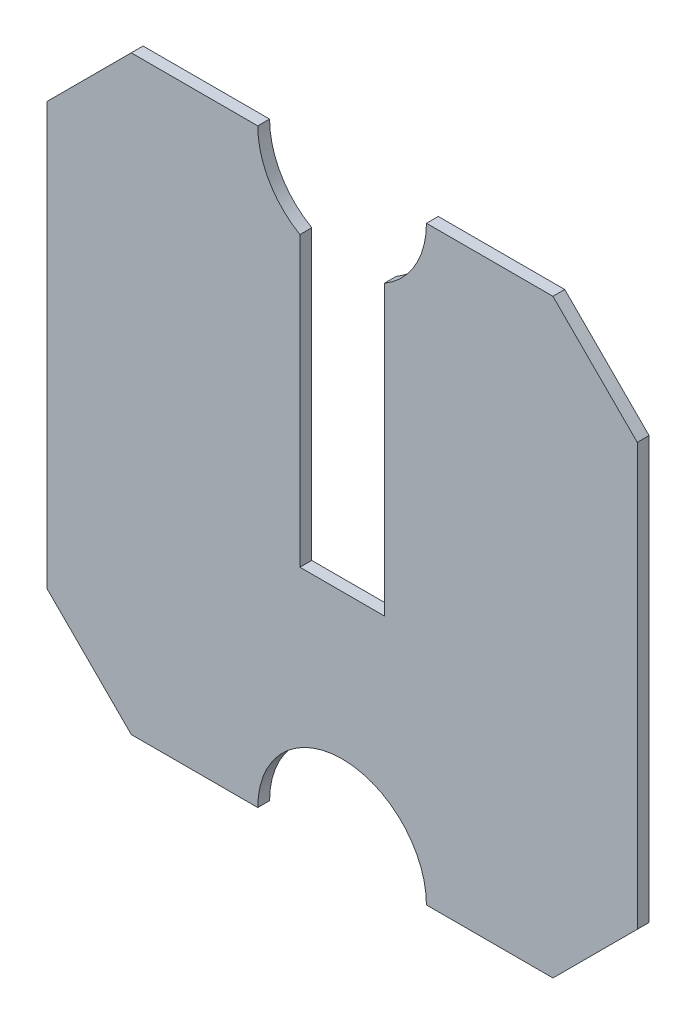
ISO-10303-21;
HEADER;
FILE_DESCRIPTION(('STEP AP214'),'2;1');
FILE_NAME('part.step','',(''),(''),'','','');
FILE_SCHEMA(('AUTOMOTIVE_DESIGN { 1 0 10303 214 1 1 1 1 }'));
ENDSEC;
DATA;
#1=APPLICATION_CONTEXT('core data for automotive mechanical design processes');
#2=APPLICATION_PROTOCOL_DEFINITION('international standard','automotive_design',2000,#1);
#3=PRODUCT_CONTEXT('',#1,'mechanical');
#4=PRODUCT('Part','Part','',(#3));
#5=PRODUCT_RELATED_PRODUCT_CATEGORY('part','',(#4));
#6=PRODUCT_DEFINITION_FORMATION('','',#4);
#7=PRODUCT_DEFINITION_CONTEXT('part definition',#1,'design');
#8=PRODUCT_DEFINITION('design','',#6,#7);
#9=PRODUCT_DEFINITION_SHAPE('','',#8);
#10=(LENGTH_UNIT() NAMED_UNIT(*) SI_UNIT(.MILLI.,.METRE.));
#11=(NAMED_UNIT(*) PLANE_ANGLE_UNIT() SI_UNIT($,.RADIAN.));
#12=(NAMED_UNIT(*) SI_UNIT($,.STERADIAN.) SOLID_ANGLE_UNIT());
#13=UNCERTAINTY_MEASURE_WITH_UNIT(LENGTH_MEASURE(1.E-05),#10,'distance_accuracy_value','');
#14=(GEOMETRIC_REPRESENTATION_CONTEXT(3) GLOBAL_UNCERTAINTY_ASSIGNED_CONTEXT((#13)) GLOBAL_UNIT_ASSIGNED_CONTEXT((#10,
#11,#12)) REPRESENTATION_CONTEXT('',''));
#15=CARTESIAN_POINT('',(0.,0.,0.));
#16=DIRECTION('',(0.,0.,1.));
#17=DIRECTION('',(1.,0.,0.));
#18=AXIS2_PLACEMENT_3D('',#15,#16,#17);
#19=CARTESIAN_POINT('',(175.,300.,7.));
#20=DIRECTION('',(0.,0.,-1.));
#21=DIRECTION('',(-1.,0.,0.));
#22=AXIS2_PLACEMENT_3D('',#19,#20,#21);
#23=CYLINDRICAL_SURFACE('',#22,50.);
#24=CARTESIAN_POINT('',(175.,300.,0.));
#25=DIRECTION('',(0.,0.,-1.));
#26=DIRECTION('',(1.,0.,0.));
#27=AXIS2_PLACEMENT_3D('',#24,#25,#26);
#28=CIRCLE('',#27,50.);
#29=CARTESIAN_POINT('',(225.,300.,0.));
#30=VERTEX_POINT('',#29);
#31=CARTESIAN_POINT('',(200.,256.698729810778,0.));
#32=VERTEX_POINT('',#31);
#33=EDGE_CURVE('E188',#30,#32,#28,.T.);
#34=ORIENTED_EDGE('',*,*,#33,.T.);
#35=DIRECTION('',(0.,0.,-1.));
#36=VECTOR('',#35,1.);
#37=CARTESIAN_POINT('',(200.,256.698729810778,7.));
#38=LINE('',#37,#36);
#39=CARTESIAN_POINT('',(200.,256.698729810778,7.));
#40=VERTEX_POINT('',#39);
#41=EDGE_CURVE('E173',#32,#40,#38,.F.);
#42=ORIENTED_EDGE('',*,*,#41,.T.);
#43=CARTESIAN_POINT('',(175.,300.,7.));
#44=DIRECTION('',(0.,0.,-1.));
#45=DIRECTION('',(1.,0.,0.));
#46=AXIS2_PLACEMENT_3D('',#43,#44,#45);
#47=CIRCLE('',#46,50.);
#48=CARTESIAN_POINT('',(225.,300.,7.));
#49=VERTEX_POINT('',#48);
#50=EDGE_CURVE('E151',#49,#40,#47,.T.);
#51=ORIENTED_EDGE('',*,*,#50,.F.);
#52=DIRECTION('',(0.,0.,-1.));
#53=VECTOR('',#52,1.);
#54=CARTESIAN_POINT('',(225.,300.,7.));
#55=LINE('',#54,#53);
#56=EDGE_CURVE('E199',#49,#30,#55,.T.);
#57=ORIENTED_EDGE('',*,*,#56,.T.);
#58=EDGE_LOOP('',(#34,#42,#51,#57));
#59=FACE_BOUND('',#58,.T.);
#60=ADVANCED_FACE('F33',(#59),#23,.F.);
#61=CARTESIAN_POINT('',(50.,-50.0000000000002,7.));
#62=DIRECTION('',(0.707106781186548,0.707106781186547,0.));
#63=DIRECTION('',(-0.707106781186547,0.707106781186548,0.));
#64=AXIS2_PLACEMENT_3D('',#61,#62,#63);
#65=PLANE('',#64);
#66=DIRECTION('',(0.707106781186547,-0.707106781186548,0.));
#67=VECTOR('',#66,1.);
#68=CARTESIAN_POINT('',(50.,-50.0000000000002,0.));
#69=LINE('',#68,#67);
#70=CARTESIAN_POINT('',(0.,0.,0.));
#71=VERTEX_POINT('',#70);
#72=CARTESIAN_POINT('',(50.,-50.0000000000002,0.));
#73=VERTEX_POINT('',#72);
#74=EDGE_CURVE('E169',#71,#73,#69,.T.);
#75=ORIENTED_EDGE('',*,*,#74,.T.);
#76=DIRECTION('',(0.,0.,-1.));
#77=VECTOR('',#76,1.);
#78=CARTESIAN_POINT('',(50.,-50.0000000000002,7.));
#79=LINE('',#78,#77);
#80=CARTESIAN_POINT('',(50.,-50.0000000000002,7.));
#81=VERTEX_POINT('',#80);
#82=EDGE_CURVE('E41',#81,#73,#79,.T.);
#83=ORIENTED_EDGE('',*,*,#82,.F.);
#84=DIRECTION('',(0.707106781186547,-0.707106781186548,0.));
#85=VECTOR('',#84,1.);
#86=CARTESIAN_POINT('',(50.,-50.0000000000002,7.));
#87=LINE('',#86,#85);
#88=CARTESIAN_POINT('',(0.,0.,7.));
#89=VERTEX_POINT('',#88);
#90=EDGE_CURVE('E195',#89,#81,#87,.T.);
#91=ORIENTED_EDGE('',*,*,#90,.F.);
#92=DIRECTION('',(0.,0.,-1.));
#93=VECTOR('',#92,1.);
#94=CARTESIAN_POINT('',(0.,0.,7.));
#95=LINE('',#94,#93);
#96=EDGE_CURVE('E165',#89,#71,#95,.T.);
#97=ORIENTED_EDGE('',*,*,#96,.T.);
#98=EDGE_LOOP('',(#75,#83,#91,#97));
#99=FACE_BOUND('',#98,.T.);
#100=ADVANCED_FACE('F35',(#99),#65,.F.);
#101=CARTESIAN_POINT('',(125.,-50.0000000000002,7.));
#102=DIRECTION('',(0.,1.,0.));
#103=DIRECTION('',(-1.,0.,0.));
#104=AXIS2_PLACEMENT_3D('',#101,#102,#103);
#105=PLANE('',#104);
#106=DIRECTION('',(1.,0.,0.));
#107=VECTOR('',#106,1.);
#108=CARTESIAN_POINT('',(125.,-50.0000000000002,0.));
#109=LINE('',#108,#107);
#110=CARTESIAN_POINT('',(125.,-50.0000000000001,0.));
#111=VERTEX_POINT('',#110);
#112=EDGE_CURVE('E172',#73,#111,#109,.T.);
#113=ORIENTED_EDGE('',*,*,#112,.T.);
#114=DIRECTION('',(0.,0.,-1.));
#115=VECTOR('',#114,1.);
#116=CARTESIAN_POINT('',(125.,-50.0000000000001,7.));
#117=LINE('',#116,#115);
#118=CARTESIAN_POINT('',(125.,-50.0000000000001,7.));
#119=VERTEX_POINT('',#118);
#120=EDGE_CURVE('E217',#119,#111,#117,.T.);
#121=ORIENTED_EDGE('',*,*,#120,.F.);
#122=DIRECTION('',(1.,0.,0.));
#123=VECTOR('',#122,1.);
#124=CARTESIAN_POINT('',(125.,-50.0000000000002,7.));
#125=LINE('',#124,#123);
#126=EDGE_CURVE('E111',#81,#119,#125,.T.);
#127=ORIENTED_EDGE('',*,*,#126,.F.);
#128=ORIENTED_EDGE('',*,*,#82,.T.);
#129=EDGE_LOOP('',(#113,#121,#127,#128));
#130=FACE_BOUND('',#129,.T.);
#131=ADVANCED_FACE('F220',(#130),#105,.F.);
#132=CARTESIAN_POINT('',(175.,-50.0000000000002,7.));
#133=DIRECTION('',(0.,0.,-1.));
#134=DIRECTION('',(-1.,0.,0.));
#135=AXIS2_PLACEMENT_3D('',#132,#133,#134);
#136=CYLINDRICAL_SURFACE('',#135,50.);
#137=CARTESIAN_POINT('',(175.,-50.0000000000002,0.));
#138=DIRECTION('',(0.,0.,-1.));
#139=DIRECTION('',(1.,0.,0.));
#140=AXIS2_PLACEMENT_3D('',#137,#138,#139);
#141=CIRCLE('',#140,50.);
#142=CARTESIAN_POINT('',(225.,-50.0000000000002,0.));
#143=VERTEX_POINT('',#142);
#144=EDGE_CURVE('E175',#111,#143,#141,.T.);
#145=ORIENTED_EDGE('',*,*,#144,.T.);
#146=DIRECTION('',(0.,0.,-1.));
#147=VECTOR('',#146,1.);
#148=CARTESIAN_POINT('',(225.,-50.0000000000002,7.));
#149=LINE('',#148,#147);
#150=CARTESIAN_POINT('',(225.,-50.0000000000002,7.));
#151=VERTEX_POINT('',#150);
#152=EDGE_CURVE('E214',#151,#143,#149,.T.);
#153=ORIENTED_EDGE('',*,*,#152,.F.);
#154=CARTESIAN_POINT('',(175.,-50.0000000000002,7.));
#155=DIRECTION('',(0.,0.,-1.));
#156=DIRECTION('',(1.,0.,0.));
#157=AXIS2_PLACEMENT_3D('',#154,#155,#156);
#158=CIRCLE('',#157,50.);
#159=EDGE_CURVE('E240',#119,#151,#158,.T.);
#160=ORIENTED_EDGE('',*,*,#159,.F.);
#161=ORIENTED_EDGE('',*,*,#120,.T.);
#162=EDGE_LOOP('',(#145,#153,#160,#161));
#163=FACE_BOUND('',#162,.T.);
#164=ADVANCED_FACE('F231',(#163),#136,.F.);
#165=CARTESIAN_POINT('',(300.,-50.0000000000001,7.));
#166=DIRECTION('',(0.,1.,0.));
#167=DIRECTION('',(-1.,0.,0.));
#168=AXIS2_PLACEMENT_3D('',#165,#166,#167);
#169=PLANE('',#168);
#170=DIRECTION('',(1.,0.,0.));
#171=VECTOR('',#170,1.);
#172=CARTESIAN_POINT('',(300.,-50.0000000000001,0.));
#173=LINE('',#172,#171);
#174=CARTESIAN_POINT('',(300.,-50.0000000000001,0.));
#175=VERTEX_POINT('',#174);
#176=EDGE_CURVE('E177',#143,#175,#173,.T.);
#177=ORIENTED_EDGE('',*,*,#176,.T.);
#178=DIRECTION('',(0.,0.,-1.));
#179=VECTOR('',#178,1.);
#180=CARTESIAN_POINT('',(300.,-50.0000000000001,7.));
#181=LINE('',#180,#179);
#182=CARTESIAN_POINT('',(300.,-50.0000000000001,7.));
#183=VERTEX_POINT('',#182);
#184=EDGE_CURVE('E211',#183,#175,#181,.T.);
#185=ORIENTED_EDGE('',*,*,#184,.F.);
#186=DIRECTION('',(1.,0.,0.));
#187=VECTOR('',#186,1.);
#188=CARTESIAN_POINT('',(300.,-50.0000000000001,7.));
#189=LINE('',#188,#187);
#190=EDGE_CURVE('E237',#151,#183,#189,.T.);
#191=ORIENTED_EDGE('',*,*,#190,.F.);
#192=ORIENTED_EDGE('',*,*,#152,.T.);
#193=EDGE_LOOP('',(#177,#185,#191,#192));
#194=FACE_BOUND('',#193,.T.);
#195=ADVANCED_FACE('F235',(#194),#169,.F.);
#196=CARTESIAN_POINT('',(350.,0.,7.));
#197=DIRECTION('',(-0.707106781186548,0.707106781186547,0.));
#198=DIRECTION('',(-0.707106781186547,-0.707106781186548,0.));
#199=AXIS2_PLACEMENT_3D('',#196,#197,#198);
#200=PLANE('',#199);
#201=DIRECTION('',(0.707106781186547,0.707106781186548,0.));
#202=VECTOR('',#201,1.);
#203=CARTESIAN_POINT('',(350.,0.,0.));
#204=LINE('',#203,#202);
#205=CARTESIAN_POINT('',(350.,0.,0.));
#206=VERTEX_POINT('',#205);
#207=EDGE_CURVE('E179',#175,#206,#204,.T.);
#208=ORIENTED_EDGE('',*,*,#207,.T.);
#209=DIRECTION('',(0.,0.,-1.));
#210=VECTOR('',#209,1.);
#211=CARTESIAN_POINT('',(350.,0.,7.));
#212=LINE('',#211,#210);
#213=CARTESIAN_POINT('',(350.,0.,7.));
#214=VERTEX_POINT('',#213);
#215=EDGE_CURVE('E208',#214,#206,#212,.T.);
#216=ORIENTED_EDGE('',*,*,#215,.F.);
#217=DIRECTION('',(0.707106781186547,0.707106781186548,0.));
#218=VECTOR('',#217,1.);
#219=CARTESIAN_POINT('',(350.,0.,7.));
#220=LINE('',#219,#218);
#221=EDGE_CURVE('E239',#183,#214,#220,.T.);
#222=ORIENTED_EDGE('',*,*,#221,.F.);
#223=ORIENTED_EDGE('',*,*,#184,.T.);
#224=EDGE_LOOP('',(#208,#216,#222,#223));
#225=FACE_BOUND('',#224,.T.);
#226=ADVANCED_FACE('F340',(#225),#200,.F.);
#227=CARTESIAN_POINT('',(350.,250.,7.));
#228=DIRECTION('',(-1.,0.,0.));
#229=DIRECTION('',(0.,-1.,0.));
#230=AXIS2_PLACEMENT_3D('',#227,#228,#229);
#231=PLANE('',#230);
#232=DIRECTION('',(0.,1.,0.));
#233=VECTOR('',#232,1.);
#234=CARTESIAN_POINT('',(350.,250.,0.));
#235=LINE('',#234,#233);
#236=CARTESIAN_POINT('',(350.,250.,0.));
#237=VERTEX_POINT('',#236);
#238=EDGE_CURVE('E181',#206,#237,#235,.T.);
#239=ORIENTED_EDGE('',*,*,#238,.T.);
#240=DIRECTION('',(0.,0.,-1.));
#241=VECTOR('',#240,1.);
#242=CARTESIAN_POINT('',(350.,250.,7.));
#243=LINE('',#242,#241);
#244=CARTESIAN_POINT('',(350.,250.,7.));
#245=VERTEX_POINT('',#244);
#246=EDGE_CURVE('E205',#245,#237,#243,.T.);
#247=ORIENTED_EDGE('',*,*,#246,.F.);
#248=DIRECTION('',(0.,1.,0.));
#249=VECTOR('',#248,1.);
#250=CARTESIAN_POINT('',(350.,250.,7.));
#251=LINE('',#250,#249);
#252=EDGE_CURVE('E242',#214,#245,#251,.T.);
#253=ORIENTED_EDGE('',*,*,#252,.F.);
#254=ORIENTED_EDGE('',*,*,#215,.T.);
#255=EDGE_LOOP('',(#239,#247,#253,#254));
#256=FACE_BOUND('',#255,.T.);
#257=ADVANCED_FACE('F334',(#256),#231,.F.);
#258=CARTESIAN_POINT('',(300.,300.,7.));
#259=DIRECTION('',(-0.707106781186547,-0.707106781186548,0.));
#260=DIRECTION('',(0.707106781186548,-0.707106781186547,0.));
#261=AXIS2_PLACEMENT_3D('',#258,#259,#260);
#262=PLANE('',#261);
#263=DIRECTION('',(-0.707106781186548,0.707106781186547,0.));
#264=VECTOR('',#263,1.);
#265=CARTESIAN_POINT('',(300.,300.,0.));
#266=LINE('',#265,#264);
#267=CARTESIAN_POINT('',(300.,300.,0.));
#268=VERTEX_POINT('',#267);
#269=EDGE_CURVE('E183',#237,#268,#266,.T.);
#270=ORIENTED_EDGE('',*,*,#269,.T.);
#271=DIRECTION('',(0.,0.,-1.));
#272=VECTOR('',#271,1.);
#273=CARTESIAN_POINT('',(300.,300.,7.));
#274=LINE('',#273,#272);
#275=CARTESIAN_POINT('',(300.,300.,7.));
#276=VERTEX_POINT('',#275);
#277=EDGE_CURVE('E202',#276,#268,#274,.T.);
#278=ORIENTED_EDGE('',*,*,#277,.F.);
#279=DIRECTION('',(-0.707106781186548,0.707106781186547,0.));
#280=VECTOR('',#279,1.);
#281=CARTESIAN_POINT('',(300.,300.,7.));
#282=LINE('',#281,#280);
#283=EDGE_CURVE('E248',#245,#276,#282,.T.);
#284=ORIENTED_EDGE('',*,*,#283,.F.);
#285=ORIENTED_EDGE('',*,*,#246,.T.);
#286=EDGE_LOOP('',(#270,#278,#284,#285));
#287=FACE_BOUND('',#286,.T.);
#288=ADVANCED_FACE('F329',(#287),#262,.F.);
#289=CARTESIAN_POINT('',(225.,300.,7.));
#290=DIRECTION('',(0.,-1.,0.));
#291=DIRECTION('',(0.,0.,-1.));
#292=AXIS2_PLACEMENT_3D('',#289,#290,#291);
#293=PLANE('',#292);
#294=DIRECTION('',(-1.,0.,0.));
#295=VECTOR('',#294,1.);
#296=CARTESIAN_POINT('',(225.,300.,0.));
#297=LINE('',#296,#295);
#298=EDGE_CURVE('E185',#268,#30,#297,.T.);
#299=ORIENTED_EDGE('',*,*,#298,.T.);
#300=ORIENTED_EDGE('',*,*,#56,.F.);
#301=DIRECTION('',(-1.,0.,0.));
#302=VECTOR('',#301,1.);
#303=CARTESIAN_POINT('',(225.,300.,7.));
#304=LINE('',#303,#302);
#305=EDGE_CURVE('E250',#276,#49,#304,.T.);
#306=ORIENTED_EDGE('',*,*,#305,.F.);
#307=ORIENTED_EDGE('',*,*,#277,.T.);
#308=EDGE_LOOP('',(#299,#300,#306,#307));
#309=FACE_BOUND('',#308,.T.);
#310=ADVANCED_FACE('F324',(#309),#293,.F.);
#311=CARTESIAN_POINT('',(150.,256.698729810778,7.));
#312=VERTEX_POINT('',#311);
#313=CARTESIAN_POINT('',(125.,300.,7.));
#314=VERTEX_POINT('',#313);
#315=EDGE_CURVE('E147',#312,#314,#47,.T.);
#316=ORIENTED_EDGE('',*,*,#315,.F.);
#317=DIRECTION('',(0.,0.,-1.));
#318=VECTOR('',#317,1.);
#319=CARTESIAN_POINT('',(150.,256.698729810778,7.));
#320=LINE('',#319,#318);
#321=CARTESIAN_POINT('',(150.,256.698729810778,0.));
#322=VERTEX_POINT('',#321);
#323=EDGE_CURVE('E268',#312,#322,#320,.T.);
#324=ORIENTED_EDGE('',*,*,#323,.T.);
#325=CARTESIAN_POINT('',(125.,300.,0.));
#326=VERTEX_POINT('',#325);
#327=EDGE_CURVE('E187',#322,#326,#28,.T.);
#328=ORIENTED_EDGE('',*,*,#327,.T.);
#329=DIRECTION('',(0.,0.,-1.));
#330=VECTOR('',#329,1.);
#331=CARTESIAN_POINT('',(125.,300.,7.));
#332=LINE('',#331,#330);
#333=EDGE_CURVE('E160',#314,#326,#332,.T.);
#334=ORIENTED_EDGE('',*,*,#333,.F.);
#335=EDGE_LOOP('',(#316,#324,#328,#334));
#336=FACE_BOUND('',#335,.T.);
#337=ADVANCED_FACE('F304',(#336),#23,.F.);
#338=CARTESIAN_POINT('',(50.,300.,7.));
#339=DIRECTION('',(0.,-1.,0.));
#340=DIRECTION('',(0.,0.,-1.));
#341=AXIS2_PLACEMENT_3D('',#338,#339,#340);
#342=PLANE('',#341);
#343=DIRECTION('',(-1.,0.,0.));
#344=VECTOR('',#343,1.);
#345=CARTESIAN_POINT('',(50.,300.,0.));
#346=LINE('',#345,#344);
#347=CARTESIAN_POINT('',(50.,300.,0.));
#348=VERTEX_POINT('',#347);
#349=EDGE_CURVE('E157',#326,#348,#346,.T.);
#350=ORIENTED_EDGE('',*,*,#349,.T.);
#351=DIRECTION('',(0.,0.,-1.));
#352=VECTOR('',#351,1.);
#353=CARTESIAN_POINT('',(50.,300.,7.));
#354=LINE('',#353,#352);
#355=CARTESIAN_POINT('',(50.,300.,7.));
#356=VERTEX_POINT('',#355);
#357=EDGE_CURVE('E154',#356,#348,#354,.T.);
#358=ORIENTED_EDGE('',*,*,#357,.F.);
#359=DIRECTION('',(-1.,0.,0.));
#360=VECTOR('',#359,1.);
#361=CARTESIAN_POINT('',(50.,300.,7.));
#362=LINE('',#361,#360);
#363=EDGE_CURVE('E138',#314,#356,#362,.T.);
#364=ORIENTED_EDGE('',*,*,#363,.F.);
#365=ORIENTED_EDGE('',*,*,#333,.T.);
#366=EDGE_LOOP('',(#350,#358,#364,#365));
#367=FACE_BOUND('',#366,.T.);
#368=ADVANCED_FACE('F155',(#367),#342,.F.);
#369=CARTESIAN_POINT('',(0.,250.,7.));
#370=DIRECTION('',(0.707106781186547,-0.707106781186548,0.));
#371=DIRECTION('',(0.707106781186548,0.707106781186547,0.));
#372=AXIS2_PLACEMENT_3D('',#369,#370,#371);
#373=PLANE('',#372);
#374=DIRECTION('',(-0.707106781186548,-0.707106781186547,0.));
#375=VECTOR('',#374,1.);
#376=CARTESIAN_POINT('',(0.,250.,0.));
#377=LINE('',#376,#375);
#378=CARTESIAN_POINT('',(0.,250.,0.));
#379=VERTEX_POINT('',#378);
#380=EDGE_CURVE('E192',#348,#379,#377,.T.);
#381=ORIENTED_EDGE('',*,*,#380,.T.);
#382=DIRECTION('',(0.,0.,-1.));
#383=VECTOR('',#382,1.);
#384=CARTESIAN_POINT('',(0.,250.,7.));
#385=LINE('',#384,#383);
#386=CARTESIAN_POINT('',(0.,250.,7.));
#387=VERTEX_POINT('',#386);
#388=EDGE_CURVE('E161',#387,#379,#385,.T.);
#389=ORIENTED_EDGE('',*,*,#388,.F.);
#390=DIRECTION('',(-0.707106781186548,-0.707106781186547,0.));
#391=VECTOR('',#390,1.);
#392=CARTESIAN_POINT('',(0.,250.,7.));
#393=LINE('',#392,#391);
#394=EDGE_CURVE('E143',#356,#387,#393,.T.);
#395=ORIENTED_EDGE('',*,*,#394,.F.);
#396=ORIENTED_EDGE('',*,*,#357,.T.);
#397=EDGE_LOOP('',(#381,#389,#395,#396));
#398=FACE_BOUND('',#397,.T.);
#399=ADVANCED_FACE('F163',(#398),#373,.F.);
#400=CARTESIAN_POINT('',(0.,0.,7.));
#401=DIRECTION('',(1.,0.,0.));
#402=DIRECTION('',(0.,0.,-1.));
#403=AXIS2_PLACEMENT_3D('',#400,#401,#402);
#404=PLANE('',#403);
#405=DIRECTION('',(0.,-1.,0.));
#406=VECTOR('',#405,1.);
#407=CARTESIAN_POINT('',(0.,0.,0.));
#408=LINE('',#407,#406);
#409=EDGE_CURVE('E102',#379,#71,#408,.T.);
#410=ORIENTED_EDGE('',*,*,#409,.T.);
#411=ORIENTED_EDGE('',*,*,#96,.F.);
#412=DIRECTION('',(0.,-1.,0.));
#413=VECTOR('',#412,1.);
#414=CARTESIAN_POINT('',(0.,0.,7.));
#415=LINE('',#414,#413);
#416=EDGE_CURVE('E57',#387,#89,#415,.T.);
#417=ORIENTED_EDGE('',*,*,#416,.F.);
#418=ORIENTED_EDGE('',*,*,#388,.T.);
#419=EDGE_LOOP('',(#410,#411,#417,#418));
#420=FACE_BOUND('',#419,.T.);
#421=ADVANCED_FACE('F305',(#420),#404,.F.);
#422=CARTESIAN_POINT('',(175.,300.,7.));
#423=DIRECTION('',(0.,0.,1.));
#424=DIRECTION('',(1.,0.,0.));
#425=AXIS2_PLACEMENT_3D('',#422,#423,#424);
#426=PLANE('',#425);
#427=DIRECTION('',(0.,1.,0.));
#428=VECTOR('',#427,1.);
#429=CARTESIAN_POINT('',(200.,298.342985896301,7.));
#430=LINE('',#429,#428);
#431=CARTESIAN_POINT('',(200.,85.8986960210935,7.));
#432=VERTEX_POINT('',#431);
#433=EDGE_CURVE('E257',#432,#40,#430,.T.);
#434=ORIENTED_EDGE('',*,*,#433,.F.);
#435=DIRECTION('',(1.,0.,0.));
#436=VECTOR('',#435,1.);
#437=CARTESIAN_POINT('',(200.,85.8986960210935,7.));
#438=LINE('',#437,#436);
#439=CARTESIAN_POINT('',(150.,85.8986960210935,7.));
#440=VERTEX_POINT('',#439);
#441=EDGE_CURVE('E279',#440,#432,#438,.T.);
#442=ORIENTED_EDGE('',*,*,#441,.F.);
#443=DIRECTION('',(0.,-1.,0.));
#444=VECTOR('',#443,1.);
#445=CARTESIAN_POINT('',(150.,298.342985896301,7.));
#446=LINE('',#445,#444);
#447=EDGE_CURVE('E283',#312,#440,#446,.T.);
#448=ORIENTED_EDGE('',*,*,#447,.F.);
#449=ORIENTED_EDGE('',*,*,#315,.T.);
#450=ORIENTED_EDGE('',*,*,#363,.T.);
#451=ORIENTED_EDGE('',*,*,#394,.T.);
#452=ORIENTED_EDGE('',*,*,#416,.T.);
#453=ORIENTED_EDGE('',*,*,#90,.T.);
#454=ORIENTED_EDGE('',*,*,#126,.T.);
#455=ORIENTED_EDGE('',*,*,#159,.T.);
#456=ORIENTED_EDGE('',*,*,#190,.T.);
#457=ORIENTED_EDGE('',*,*,#221,.T.);
#458=ORIENTED_EDGE('',*,*,#252,.T.);
#459=ORIENTED_EDGE('',*,*,#283,.T.);
#460=ORIENTED_EDGE('',*,*,#305,.T.);
#461=ORIENTED_EDGE('',*,*,#50,.T.);
#462=EDGE_LOOP('',(#434,#442,#448,#449,#450,#451,#452,#453,#454,#455,#456,#457,#458,#459,#460,#461));
#463=FACE_BOUND('',#462,.T.);
#464=ADVANCED_FACE('F141',(#463),#426,.T.);
#465=CARTESIAN_POINT('',(175.,300.,0.));
#466=DIRECTION('',(0.,0.,1.));
#467=DIRECTION('',(1.,0.,0.));
#468=AXIS2_PLACEMENT_3D('',#465,#466,#467);
#469=PLANE('',#468);
#470=DIRECTION('',(1.,0.,0.));
#471=VECTOR('',#470,1.);
#472=CARTESIAN_POINT('',(200.,85.8986960210935,0.));
#473=LINE('',#472,#471);
#474=CARTESIAN_POINT('',(150.,85.8986960210935,0.));
#475=VERTEX_POINT('',#474);
#476=CARTESIAN_POINT('',(200.,85.8986960210935,0.));
#477=VERTEX_POINT('',#476);
#478=EDGE_CURVE('E48',#475,#477,#473,.T.);
#479=ORIENTED_EDGE('',*,*,#478,.T.);
#480=DIRECTION('',(0.,1.,0.));
#481=VECTOR('',#480,1.);
#482=CARTESIAN_POINT('',(200.,298.342985896301,0.));
#483=LINE('',#482,#481);
#484=EDGE_CURVE('E282',#477,#32,#483,.T.);
#485=ORIENTED_EDGE('',*,*,#484,.T.);
#486=ORIENTED_EDGE('',*,*,#33,.F.);
#487=ORIENTED_EDGE('',*,*,#298,.F.);
#488=ORIENTED_EDGE('',*,*,#269,.F.);
#489=ORIENTED_EDGE('',*,*,#238,.F.);
#490=ORIENTED_EDGE('',*,*,#207,.F.);
#491=ORIENTED_EDGE('',*,*,#176,.F.);
#492=ORIENTED_EDGE('',*,*,#144,.F.);
#493=ORIENTED_EDGE('',*,*,#112,.F.);
#494=ORIENTED_EDGE('',*,*,#74,.F.);
#495=ORIENTED_EDGE('',*,*,#409,.F.);
#496=ORIENTED_EDGE('',*,*,#380,.F.);
#497=ORIENTED_EDGE('',*,*,#349,.F.);
#498=ORIENTED_EDGE('',*,*,#327,.F.);
#499=DIRECTION('',(0.,-1.,0.));
#500=VECTOR('',#499,1.);
#501=CARTESIAN_POINT('',(150.,300.,0.));
#502=LINE('',#501,#500);
#503=EDGE_CURVE('E11',#322,#475,#502,.T.);
#504=ORIENTED_EDGE('',*,*,#503,.T.);
#505=EDGE_LOOP('',(#479,#485,#486,#487,#488,#489,#490,#491,#492,#493,#494,#495,#496,#497,#498,#504));
#506=FACE_BOUND('',#505,.T.);
#507=ADVANCED_FACE('F225',(#506),#469,.F.);
#508=CARTESIAN_POINT('',(200.,298.342985896301,0.));
#509=DIRECTION('',(1.,0.,0.));
#510=DIRECTION('',(0.,0.,-1.));
#511=AXIS2_PLACEMENT_3D('',#508,#509,#510);
#512=PLANE('',#511);
#513=ORIENTED_EDGE('',*,*,#484,.F.);
#514=DIRECTION('',(0.,0.,1.));
#515=VECTOR('',#514,1.);
#516=CARTESIAN_POINT('',(200.,85.8986960210935,0.));
#517=LINE('',#516,#515);
#518=EDGE_CURVE('E271',#477,#432,#517,.T.);
#519=ORIENTED_EDGE('',*,*,#518,.T.);
#520=ORIENTED_EDGE('',*,*,#433,.T.);
#521=ORIENTED_EDGE('',*,*,#41,.F.);
#522=EDGE_LOOP('',(#513,#519,#520,#521));
#523=FACE_BOUND('',#522,.T.);
#524=ADVANCED_FACE('F290',(#523),#512,.F.);
#525=CARTESIAN_POINT('',(150.,298.342985896301,0.));
#526=DIRECTION('',(-1.,0.,0.));
#527=DIRECTION('',(0.,0.,1.));
#528=AXIS2_PLACEMENT_3D('',#525,#526,#527);
#529=PLANE('',#528);
#530=ORIENTED_EDGE('',*,*,#447,.T.);
#531=DIRECTION('',(0.,0.,1.));
#532=VECTOR('',#531,1.);
#533=CARTESIAN_POINT('',(150.,85.8986960210935,0.));
#534=LINE('',#533,#532);
#535=EDGE_CURVE('E275',#475,#440,#534,.T.);
#536=ORIENTED_EDGE('',*,*,#535,.F.);
#537=ORIENTED_EDGE('',*,*,#503,.F.);
#538=ORIENTED_EDGE('',*,*,#323,.F.);
#539=EDGE_LOOP('',(#530,#536,#537,#538));
#540=FACE_BOUND('',#539,.T.);
#541=ADVANCED_FACE('F301',(#540),#529,.F.);
#542=CARTESIAN_POINT('',(200.,85.8986960210935,0.));
#543=DIRECTION('',(0.,-1.,0.));
#544=DIRECTION('',(0.,0.,-1.));
#545=AXIS2_PLACEMENT_3D('',#542,#543,#544);
#546=PLANE('',#545);
#547=ORIENTED_EDGE('',*,*,#441,.T.);
#548=ORIENTED_EDGE('',*,*,#518,.F.);
#549=ORIENTED_EDGE('',*,*,#478,.F.);
#550=ORIENTED_EDGE('',*,*,#535,.T.);
#551=EDGE_LOOP('',(#547,#548,#549,#550));
#552=FACE_BOUND('',#551,.T.);
#553=ADVANCED_FACE('F425',(#552),#546,.F.);
#554=CLOSED_SHELL('',(#60,#100,#131,#164,#195,#226,#257,#288,#310,#337,#368,#399,#421,#464,#507,
#524,#541,#553));
#555=MANIFOLD_SOLID_BREP('B2',#554);
#556=ADVANCED_BREP_SHAPE_REPRESENTATION('',(#18,#555),#14);
#557=SHAPE_DEFINITION_REPRESENTATION(#9,#556);
ENDSEC;
END-ISO-10303-21;
